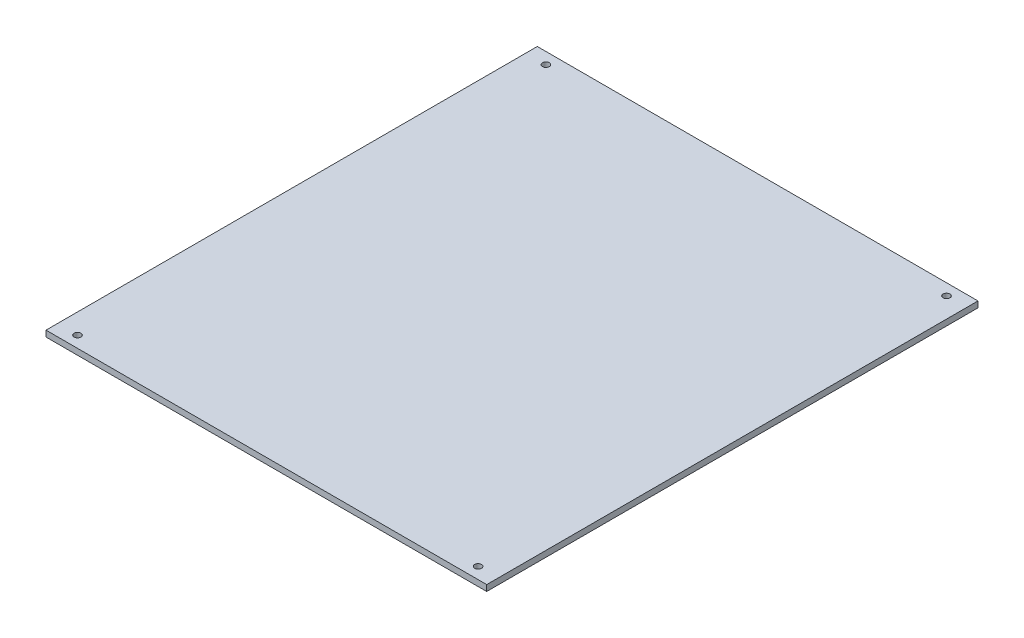
ISO-10303-21;
HEADER;
FILE_DESCRIPTION(('STEP AP214'),'2;1');
FILE_NAME('part.step','',(''),(''),'','','');
FILE_SCHEMA(('AUTOMOTIVE_DESIGN { 1 0 10303 214 1 1 1 1 }'));
ENDSEC;
DATA;
#1=APPLICATION_CONTEXT('core data for automotive mechanical design processes');
#2=APPLICATION_PROTOCOL_DEFINITION('international standard','automotive_design',2000,#1);
#3=PRODUCT_CONTEXT('',#1,'mechanical');
#4=PRODUCT('Part','Part','',(#3));
#5=PRODUCT_RELATED_PRODUCT_CATEGORY('part','',(#4));
#6=PRODUCT_DEFINITION_FORMATION('','',#4);
#7=PRODUCT_DEFINITION_CONTEXT('part definition',#1,'design');
#8=PRODUCT_DEFINITION('design','',#6,#7);
#9=PRODUCT_DEFINITION_SHAPE('','',#8);
#10=(LENGTH_UNIT() NAMED_UNIT(*) SI_UNIT(.MILLI.,.METRE.));
#11=(NAMED_UNIT(*) PLANE_ANGLE_UNIT() SI_UNIT($,.RADIAN.));
#12=(NAMED_UNIT(*) SI_UNIT($,.STERADIAN.) SOLID_ANGLE_UNIT());
#13=UNCERTAINTY_MEASURE_WITH_UNIT(LENGTH_MEASURE(1.E-05),#10,'distance_accuracy_value','');
#14=(GEOMETRIC_REPRESENTATION_CONTEXT(3) GLOBAL_UNCERTAINTY_ASSIGNED_CONTEXT((#13)) GLOBAL_UNIT_ASSIGNED_CONTEXT((#10,
#11,#12)) REPRESENTATION_CONTEXT('',''));
#15=CARTESIAN_POINT('',(0.,0.,0.));
#16=DIRECTION('',(0.,0.,1.));
#17=DIRECTION('',(1.,0.,0.));
#18=AXIS2_PLACEMENT_3D('',#15,#16,#17);
#19=CARTESIAN_POINT('',(-40.2843191497664,-3.,245.));
#20=DIRECTION('',(0.,1.,0.));
#21=DIRECTION('',(0.,0.,1.));
#22=AXIS2_PLACEMENT_3D('',#19,#20,#21);
#23=PLANE('',#22);
#24=CARTESIAN_POINT('',(-30.2843191497664,-3.,5.7));
#25=DIRECTION('',(0.,1.,0.));
#26=DIRECTION('',(0.,0.,1.));
#27=AXIS2_PLACEMENT_3D('',#24,#25,#26);
#28=CIRCLE('',#27,1.7);
#29=CARTESIAN_POINT('',(-30.2843191497664,-3.,7.4));
#30=VERTEX_POINT('',#29);
#31=EDGE_CURVE('E125',#30,#30,#28,.T.);
#32=ORIENTED_EDGE('',*,*,#31,.T.);
#33=EDGE_LOOP('',(#32));
#34=FACE_BOUND('',#33,.T.);
#35=CARTESIAN_POINT('',(169.485680850234,-3.,5.70000000000001));
#36=DIRECTION('',(0.,1.,0.));
#37=DIRECTION('',(0.,0.,1.));
#38=AXIS2_PLACEMENT_3D('',#35,#36,#37);
#39=CIRCLE('',#38,1.70000000000001);
#40=CARTESIAN_POINT('',(169.485680850234,-3.,7.40000000000002));
#41=VERTEX_POINT('',#40);
#42=EDGE_CURVE('E119',#41,#41,#39,.T.);
#43=ORIENTED_EDGE('',*,*,#42,.T.);
#44=EDGE_LOOP('',(#43));
#45=FACE_BOUND('',#44,.T.);
#46=CARTESIAN_POINT('',(-30.2843191497664,-3.,239.3));
#47=DIRECTION('',(0.,1.,0.));
#48=DIRECTION('',(0.,0.,1.));
#49=AXIS2_PLACEMENT_3D('',#46,#47,#48);
#50=CIRCLE('',#49,1.7);
#51=CARTESIAN_POINT('',(-30.2843191497664,-3.,241.));
#52=VERTEX_POINT('',#51);
#53=EDGE_CURVE('E113',#52,#52,#50,.T.);
#54=ORIENTED_EDGE('',*,*,#53,.T.);
#55=EDGE_LOOP('',(#54));
#56=FACE_BOUND('',#55,.T.);
#57=CARTESIAN_POINT('',(169.485680850234,-3.,239.3));
#58=DIRECTION('',(0.,1.,0.));
#59=DIRECTION('',(0.,0.,1.));
#60=AXIS2_PLACEMENT_3D('',#57,#58,#59);
#61=CIRCLE('',#60,1.70000000000001);
#62=CARTESIAN_POINT('',(169.485680850234,-3.,241.));
#63=VERTEX_POINT('',#62);
#64=EDGE_CURVE('E98',#63,#63,#61,.T.);
#65=ORIENTED_EDGE('',*,*,#64,.T.);
#66=EDGE_LOOP('',(#65));
#67=FACE_BOUND('',#66,.T.);
#68=DIRECTION('',(1.,0.,0.));
#69=VECTOR('',#68,1.);
#70=CARTESIAN_POINT('',(-40.2843191497664,-3.,0.));
#71=LINE('',#70,#69);
#72=CARTESIAN_POINT('',(-40.2843191497664,-3.,0.));
#73=VERTEX_POINT('',#72);
#74=CARTESIAN_POINT('',(179.485680850234,-3.,0.));
#75=VERTEX_POINT('',#74);
#76=EDGE_CURVE('E96',#73,#75,#71,.T.);
#77=ORIENTED_EDGE('',*,*,#76,.T.);
#78=DIRECTION('',(0.,0.,-1.));
#79=VECTOR('',#78,1.);
#80=CARTESIAN_POINT('',(179.485680850234,-3.,245.));
#81=LINE('',#80,#79);
#82=CARTESIAN_POINT('',(179.485680850234,-3.,245.));
#83=VERTEX_POINT('',#82);
#84=EDGE_CURVE('E11',#83,#75,#81,.T.);
#85=ORIENTED_EDGE('',*,*,#84,.F.);
#86=DIRECTION('',(1.,0.,0.));
#87=VECTOR('',#86,1.);
#88=CARTESIAN_POINT('',(-40.2843191497664,-3.,245.));
#89=LINE('',#88,#87);
#90=CARTESIAN_POINT('',(-40.2843191497664,-3.,245.));
#91=VERTEX_POINT('',#90);
#92=EDGE_CURVE('E73',#91,#83,#89,.T.);
#93=ORIENTED_EDGE('',*,*,#92,.F.);
#94=DIRECTION('',(0.,0.,-1.));
#95=VECTOR('',#94,1.);
#96=CARTESIAN_POINT('',(-40.2843191497664,-3.,245.));
#97=LINE('',#96,#95);
#98=EDGE_CURVE('E49',#91,#73,#97,.T.);
#99=ORIENTED_EDGE('',*,*,#98,.T.);
#100=EDGE_LOOP('',(#77,#85,#93,#99));
#101=FACE_BOUND('',#100,.T.);
#102=ADVANCED_FACE('F33',(#34,#45,#56,#67,#101),#23,.F.);
#103=CARTESIAN_POINT('',(179.485680850234,0.,245.));
#104=DIRECTION('',(1.,0.,0.));
#105=DIRECTION('',(0.,0.,-1.));
#106=AXIS2_PLACEMENT_3D('',#103,#104,#105);
#107=PLANE('',#106);
#108=DIRECTION('',(0.,-1.,0.));
#109=VECTOR('',#108,1.);
#110=CARTESIAN_POINT('',(179.485680850234,0.,0.));
#111=LINE('',#110,#109);
#112=CARTESIAN_POINT('',(179.485680850234,0.,0.));
#113=VERTEX_POINT('',#112);
#114=EDGE_CURVE('E82',#113,#75,#111,.T.);
#115=ORIENTED_EDGE('',*,*,#114,.F.);
#116=DIRECTION('',(0.,0.,-1.));
#117=VECTOR('',#116,1.);
#118=CARTESIAN_POINT('',(179.485680850234,0.,245.));
#119=LINE('',#118,#117);
#120=CARTESIAN_POINT('',(179.485680850234,0.,245.));
#121=VERTEX_POINT('',#120);
#122=EDGE_CURVE('E41',#121,#113,#119,.T.);
#123=ORIENTED_EDGE('',*,*,#122,.F.);
#124=DIRECTION('',(0.,-1.,0.));
#125=VECTOR('',#124,1.);
#126=CARTESIAN_POINT('',(179.485680850234,0.,245.));
#127=LINE('',#126,#125);
#128=EDGE_CURVE('E80',#121,#83,#127,.T.);
#129=ORIENTED_EDGE('',*,*,#128,.T.);
#130=ORIENTED_EDGE('',*,*,#84,.T.);
#131=EDGE_LOOP('',(#115,#123,#129,#130));
#132=FACE_BOUND('',#131,.T.);
#133=ADVANCED_FACE('F79',(#132),#107,.T.);
#134=CARTESIAN_POINT('',(-40.2843191497664,0.,245.));
#135=DIRECTION('',(0.,1.,0.));
#136=DIRECTION('',(0.,0.,1.));
#137=AXIS2_PLACEMENT_3D('',#134,#135,#136);
#138=PLANE('',#137);
#139=CARTESIAN_POINT('',(-30.2843191497664,0.,5.7));
#140=DIRECTION('',(0.,1.,0.));
#141=DIRECTION('',(0.,0.,1.));
#142=AXIS2_PLACEMENT_3D('',#139,#140,#141);
#143=CIRCLE('',#142,1.69999999999999);
#144=CARTESIAN_POINT('',(-30.2843191497664,0.,7.39999999999999));
#145=VERTEX_POINT('',#144);
#146=EDGE_CURVE('E128',#145,#145,#143,.T.);
#147=ORIENTED_EDGE('',*,*,#146,.F.);
#148=EDGE_LOOP('',(#147));
#149=FACE_BOUND('',#148,.T.);
#150=CARTESIAN_POINT('',(169.485680850234,0.,5.70000000000001));
#151=DIRECTION('',(0.,1.,0.));
#152=DIRECTION('',(0.,0.,1.));
#153=AXIS2_PLACEMENT_3D('',#150,#151,#152);
#154=CIRCLE('',#153,1.69999999999998);
#155=CARTESIAN_POINT('',(169.485680850234,0.,7.39999999999999));
#156=VERTEX_POINT('',#155);
#157=EDGE_CURVE('E122',#156,#156,#154,.T.);
#158=ORIENTED_EDGE('',*,*,#157,.F.);
#159=EDGE_LOOP('',(#158));
#160=FACE_BOUND('',#159,.T.);
#161=CARTESIAN_POINT('',(-30.2843191497664,0.,239.3));
#162=DIRECTION('',(0.,1.,0.));
#163=DIRECTION('',(0.,0.,1.));
#164=AXIS2_PLACEMENT_3D('',#161,#162,#163);
#165=CIRCLE('',#164,1.69999999999999);
#166=CARTESIAN_POINT('',(-30.2843191497664,0.,241.));
#167=VERTEX_POINT('',#166);
#168=EDGE_CURVE('E116',#167,#167,#165,.T.);
#169=ORIENTED_EDGE('',*,*,#168,.F.);
#170=EDGE_LOOP('',(#169));
#171=FACE_BOUND('',#170,.T.);
#172=CARTESIAN_POINT('',(169.485680850234,0.,239.3));
#173=DIRECTION('',(0.,1.,0.));
#174=DIRECTION('',(0.,0.,1.));
#175=AXIS2_PLACEMENT_3D('',#172,#173,#174);
#176=CIRCLE('',#175,1.69999999999998);
#177=CARTESIAN_POINT('',(169.485680850234,0.,241.));
#178=VERTEX_POINT('',#177);
#179=EDGE_CURVE('E110',#178,#178,#176,.T.);
#180=ORIENTED_EDGE('',*,*,#179,.F.);
#181=EDGE_LOOP('',(#180));
#182=FACE_BOUND('',#181,.T.);
#183=DIRECTION('',(1.,0.,0.));
#184=VECTOR('',#183,1.);
#185=CARTESIAN_POINT('',(-40.2843191497664,0.,0.));
#186=LINE('',#185,#184);
#187=CARTESIAN_POINT('',(-40.2843191497664,0.,0.));
#188=VERTEX_POINT('',#187);
#189=EDGE_CURVE('E100',#188,#113,#186,.T.);
#190=ORIENTED_EDGE('',*,*,#189,.F.);
#191=DIRECTION('',(0.,0.,-1.));
#192=VECTOR('',#191,1.);
#193=CARTESIAN_POINT('',(-40.2843191497664,0.,245.));
#194=LINE('',#193,#192);
#195=CARTESIAN_POINT('',(-40.2843191497664,0.,245.));
#196=VERTEX_POINT('',#195);
#197=EDGE_CURVE('E62',#196,#188,#194,.T.);
#198=ORIENTED_EDGE('',*,*,#197,.F.);
#199=DIRECTION('',(1.,0.,0.));
#200=VECTOR('',#199,1.);
#201=CARTESIAN_POINT('',(-40.2843191497664,0.,245.));
#202=LINE('',#201,#200);
#203=EDGE_CURVE('E88',#196,#121,#202,.T.);
#204=ORIENTED_EDGE('',*,*,#203,.T.);
#205=ORIENTED_EDGE('',*,*,#122,.T.);
#206=EDGE_LOOP('',(#190,#198,#204,#205));
#207=FACE_BOUND('',#206,.T.);
#208=ADVANCED_FACE('F90',(#149,#160,#171,#182,#207),#138,.T.);
#209=CARTESIAN_POINT('',(-40.2843191497664,-3.,245.));
#210=DIRECTION('',(-1.,0.,0.));
#211=DIRECTION('',(0.,0.,1.));
#212=AXIS2_PLACEMENT_3D('',#209,#210,#211);
#213=PLANE('',#212);
#214=DIRECTION('',(0.,1.,0.));
#215=VECTOR('',#214,1.);
#216=CARTESIAN_POINT('',(-40.2843191497664,-3.,0.));
#217=LINE('',#216,#215);
#218=EDGE_CURVE('E102',#73,#188,#217,.T.);
#219=ORIENTED_EDGE('',*,*,#218,.F.);
#220=ORIENTED_EDGE('',*,*,#98,.F.);
#221=DIRECTION('',(0.,1.,0.));
#222=VECTOR('',#221,1.);
#223=CARTESIAN_POINT('',(-40.2843191497664,-3.,245.));
#224=LINE('',#223,#222);
#225=EDGE_CURVE('E91',#91,#196,#224,.T.);
#226=ORIENTED_EDGE('',*,*,#225,.T.);
#227=ORIENTED_EDGE('',*,*,#197,.T.);
#228=EDGE_LOOP('',(#219,#220,#226,#227));
#229=FACE_BOUND('',#228,.T.);
#230=ADVANCED_FACE('F136',(#229),#213,.T.);
#231=CARTESIAN_POINT('',(179.485680850234,-3.,245.));
#232=DIRECTION('',(0.,0.,-1.));
#233=DIRECTION('',(-1.,0.,0.));
#234=AXIS2_PLACEMENT_3D('',#231,#232,#233);
#235=PLANE('',#234);
#236=ORIENTED_EDGE('',*,*,#92,.T.);
#237=ORIENTED_EDGE('',*,*,#128,.F.);
#238=ORIENTED_EDGE('',*,*,#203,.F.);
#239=ORIENTED_EDGE('',*,*,#225,.F.);
#240=EDGE_LOOP('',(#236,#237,#238,#239));
#241=FACE_BOUND('',#240,.T.);
#242=ADVANCED_FACE('F87',(#241),#235,.F.);
#243=CARTESIAN_POINT('',(179.485680850234,-3.,0.));
#244=DIRECTION('',(0.,0.,-1.));
#245=DIRECTION('',(-1.,0.,0.));
#246=AXIS2_PLACEMENT_3D('',#243,#244,#245);
#247=PLANE('',#246);
#248=ORIENTED_EDGE('',*,*,#76,.F.);
#249=ORIENTED_EDGE('',*,*,#218,.T.);
#250=ORIENTED_EDGE('',*,*,#189,.T.);
#251=ORIENTED_EDGE('',*,*,#114,.T.);
#252=EDGE_LOOP('',(#248,#249,#250,#251));
#253=FACE_BOUND('',#252,.T.);
#254=ADVANCED_FACE('F147',(#253),#247,.T.);
#255=CARTESIAN_POINT('',(169.485680850234,0.,239.3));
#256=DIRECTION('',(0.,1.,0.));
#257=DIRECTION('',(0.,0.,1.));
#258=AXIS2_PLACEMENT_3D('',#255,#256,#257);
#259=CYLINDRICAL_SURFACE('',#258,1.69999999999999);
#260=ORIENTED_EDGE('',*,*,#64,.F.);
#261=EDGE_LOOP('',(#260));
#262=FACE_BOUND('',#261,.T.);
#263=ORIENTED_EDGE('',*,*,#179,.T.);
#264=EDGE_LOOP('',(#263));
#265=FACE_BOUND('',#264,.T.);
#266=ADVANCED_FACE('F144',(#262,#265),#259,.F.);
#267=CARTESIAN_POINT('',(-30.2843191497664,0.,239.3));
#268=DIRECTION('',(0.,1.,0.));
#269=DIRECTION('',(0.,0.,1.));
#270=AXIS2_PLACEMENT_3D('',#267,#268,#269);
#271=CYLINDRICAL_SURFACE('',#270,1.69999999999999);
#272=ORIENTED_EDGE('',*,*,#53,.F.);
#273=EDGE_LOOP('',(#272));
#274=FACE_BOUND('',#273,.T.);
#275=ORIENTED_EDGE('',*,*,#168,.T.);
#276=EDGE_LOOP('',(#275));
#277=FACE_BOUND('',#276,.T.);
#278=ADVANCED_FACE('F146',(#274,#277),#271,.F.);
#279=CARTESIAN_POINT('',(169.485680850234,0.,5.70000000000001));
#280=DIRECTION('',(0.,1.,0.));
#281=DIRECTION('',(0.,0.,1.));
#282=AXIS2_PLACEMENT_3D('',#279,#280,#281);
#283=CYLINDRICAL_SURFACE('',#282,1.69999999999999);
#284=ORIENTED_EDGE('',*,*,#42,.F.);
#285=EDGE_LOOP('',(#284));
#286=FACE_BOUND('',#285,.T.);
#287=ORIENTED_EDGE('',*,*,#157,.T.);
#288=EDGE_LOOP('',(#287));
#289=FACE_BOUND('',#288,.T.);
#290=ADVANCED_FACE('F154',(#286,#289),#283,.F.);
#291=CARTESIAN_POINT('',(-30.2843191497664,0.,5.7));
#292=DIRECTION('',(0.,1.,0.));
#293=DIRECTION('',(0.,0.,1.));
#294=AXIS2_PLACEMENT_3D('',#291,#292,#293);
#295=CYLINDRICAL_SURFACE('',#294,1.69999999999999);
#296=ORIENTED_EDGE('',*,*,#31,.F.);
#297=EDGE_LOOP('',(#296));
#298=FACE_BOUND('',#297,.T.);
#299=ORIENTED_EDGE('',*,*,#146,.T.);
#300=EDGE_LOOP('',(#299));
#301=FACE_BOUND('',#300,.T.);
#302=ADVANCED_FACE('F132',(#298,#301),#295,.F.);
#303=CLOSED_SHELL('',(#102,#133,#208,#230,#242,#254,#266,#278,#290,#302));
#304=MANIFOLD_SOLID_BREP('B2',#303);
#305=ADVANCED_BREP_SHAPE_REPRESENTATION('',(#18,#304),#14);
#306=SHAPE_DEFINITION_REPRESENTATION(#9,#305);
ENDSEC;
END-ISO-10303-21;
